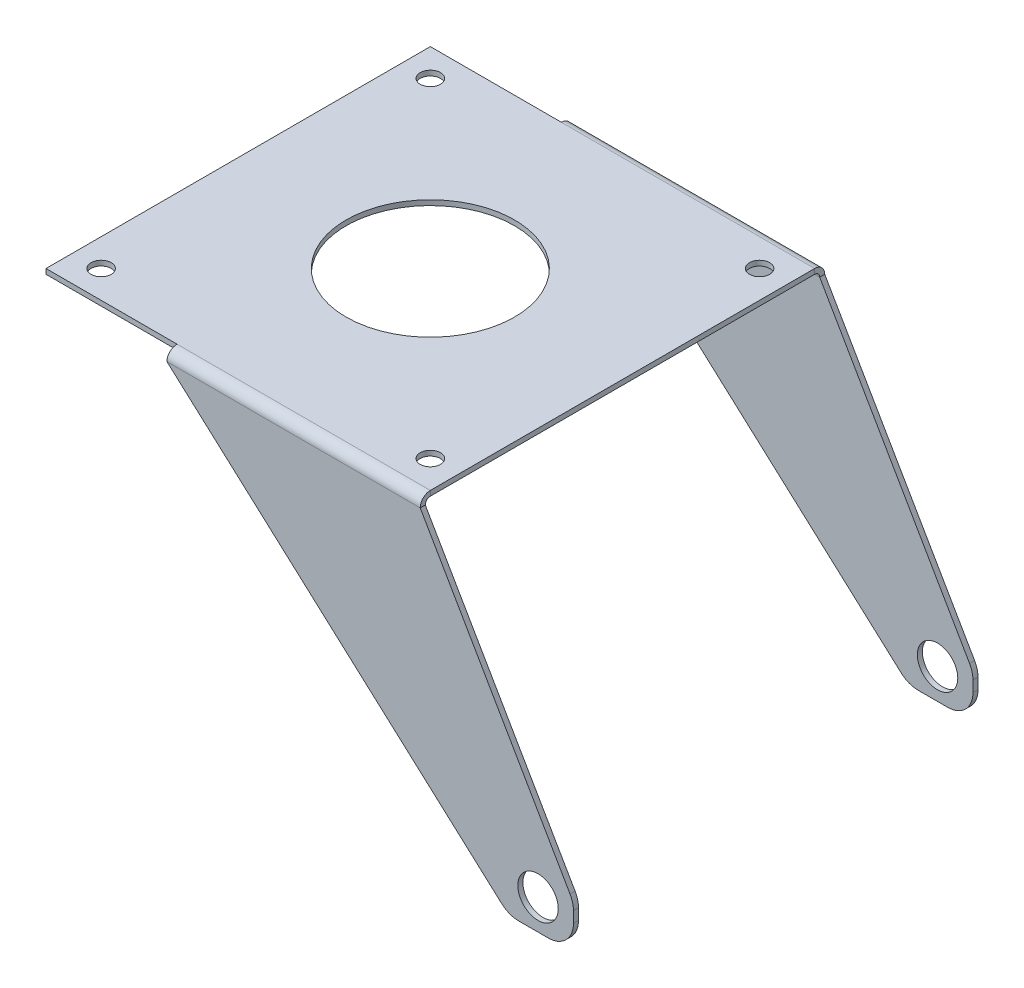
ISO-10303-21;
HEADER;
FILE_DESCRIPTION(('STEP AP214'),'2;1');
FILE_NAME('part.step','',(''),(''),'','','');
FILE_SCHEMA(('AUTOMOTIVE_DESIGN { 1 0 10303 214 1 1 1 1 }'));
ENDSEC;
DATA;
#1=APPLICATION_CONTEXT('core data for automotive mechanical design processes');
#2=APPLICATION_PROTOCOL_DEFINITION('international standard','automotive_design',2000,#1);
#3=PRODUCT_CONTEXT('',#1,'mechanical');
#4=PRODUCT('Part','Part','',(#3));
#5=PRODUCT_RELATED_PRODUCT_CATEGORY('part','',(#4));
#6=PRODUCT_DEFINITION_FORMATION('','',#4);
#7=PRODUCT_DEFINITION_CONTEXT('part definition',#1,'design');
#8=PRODUCT_DEFINITION('design','',#6,#7);
#9=PRODUCT_DEFINITION_SHAPE('','',#8);
#10=(LENGTH_UNIT() NAMED_UNIT(*) SI_UNIT(.MILLI.,.METRE.));
#11=(NAMED_UNIT(*) PLANE_ANGLE_UNIT() SI_UNIT($,.RADIAN.));
#12=(NAMED_UNIT(*) SI_UNIT($,.STERADIAN.) SOLID_ANGLE_UNIT());
#13=UNCERTAINTY_MEASURE_WITH_UNIT(LENGTH_MEASURE(1.E-05),#10,'distance_accuracy_value','');
#14=(GEOMETRIC_REPRESENTATION_CONTEXT(3) GLOBAL_UNCERTAINTY_ASSIGNED_CONTEXT((#13)) GLOBAL_UNIT_ASSIGNED_CONTEXT((#10,
#11,#12)) REPRESENTATION_CONTEXT('',''));
#15=CARTESIAN_POINT('',(0.,0.,0.));
#16=DIRECTION('',(0.,0.,1.));
#17=DIRECTION('',(1.,0.,0.));
#18=AXIS2_PLACEMENT_3D('',#15,#16,#17);
#19=CARTESIAN_POINT('',(0.,1.3533046551308E-13,40.));
#20=DIRECTION('',(0.,0.,-1.));
#21=DIRECTION('',(0.,-1.,0.));
#22=AXIS2_PLACEMENT_3D('',#19,#20,#21);
#23=PLANE('',#22);
#24=DIRECTION('',(-0.742561648426638,0.669777723043933,0.));
#25=VECTOR('',#24,1.);
#26=CARTESIAN_POINT('',(-6.41552604117496,-7.1126934037284,40.));
#27=LINE('',#26,#25);
#28=CARTESIAN_POINT('',(54.1179164484167,-61.7128082421332,40.0000000000002));
#29=VERTEX_POINT('',#28);
#30=CARTESIAN_POINT('',(-12.0838095793594,-1.99999999999999,40.));
#31=VERTEX_POINT('',#30);
#32=EDGE_CURVE('E229',#29,#31,#27,.T.);
#33=ORIENTED_EDGE('',*,*,#32,.F.);
#34=CARTESIAN_POINT('',(57.4668050636364,-58.,40.0000000000002));
#35=DIRECTION('',(0.,0.,-1.));
#36=DIRECTION('',(0.,1.,0.));
#37=AXIS2_PLACEMENT_3D('',#34,#35,#36);
#38=CIRCLE('',#37,5.);
#39=CARTESIAN_POINT('',(57.4668050636364,-63.,40.0000000000002));
#40=VERTEX_POINT('',#39);
#41=EDGE_CURVE('E313',#29,#40,#38,.F.);
#42=ORIENTED_EDGE('',*,*,#41,.T.);
#43=DIRECTION('',(1.,0.,0.));
#44=VECTOR('',#43,1.);
#45=CARTESIAN_POINT('',(-12.0838095793594,-63.,40.0000000000002));
#46=LINE('',#45,#44);
#47=CARTESIAN_POINT('',(63.3,-63.,40.0000000000002));
#48=VERTEX_POINT('',#47);
#49=EDGE_CURVE('E269',#48,#40,#46,.F.);
#50=ORIENTED_EDGE('',*,*,#49,.F.);
#51=CARTESIAN_POINT('',(63.3,-58.,40.0000000000002));
#52=DIRECTION('',(0.,0.,-1.));
#53=DIRECTION('',(0.,1.,0.));
#54=AXIS2_PLACEMENT_3D('',#51,#52,#53);
#55=CIRCLE('',#54,5.);
#56=CARTESIAN_POINT('',(68.3,-58.,40.0000000000002));
#57=VERTEX_POINT('',#56);
#58=EDGE_CURVE('E301',#48,#57,#55,.F.);
#59=ORIENTED_EDGE('',*,*,#58,.T.);
#60=DIRECTION('',(0.,-1.,0.));
#61=VECTOR('',#60,1.);
#62=CARTESIAN_POINT('',(68.3,-1.99999999999999,40.));
#63=LINE('',#62,#61);
#64=CARTESIAN_POINT('',(68.3,-55.8223144811084,40.0000000000002));
#65=VERTEX_POINT('',#64);
#66=EDGE_CURVE('E325',#65,#57,#63,.T.);
#67=ORIENTED_EDGE('',*,*,#66,.F.);
#68=CARTESIAN_POINT('',(63.3,-55.8223144811084,40.0000000000002));
#69=DIRECTION('',(0.,0.,-1.));
#70=DIRECTION('',(0.,1.,0.));
#71=AXIS2_PLACEMENT_3D('',#68,#69,#70);
#72=CIRCLE('',#71,5.);
#73=CARTESIAN_POINT('',(67.6301571614719,-53.3223666902629,40.0000000000002));
#74=VERTEX_POINT('',#73);
#75=EDGE_CURVE('E311',#65,#74,#72,.F.);
#76=ORIENTED_EDGE('',*,*,#75,.T.);
#77=DIRECTION('',(0.499989558169104,-0.866031432294386,0.));
#78=VECTOR('',#77,1.);
#79=CARTESIAN_POINT('',(27.634383439044,15.954274464794,39.9999999999999));
#80=LINE('',#79,#78);
#81=CARTESIAN_POINT('',(38.,-1.99999999999999,40.));
#82=VERTEX_POINT('',#81);
#83=EDGE_CURVE('E265',#82,#74,#80,.T.);
#84=ORIENTED_EDGE('',*,*,#83,.F.);
#85=DIRECTION('',(-1.,0.,0.));
#86=VECTOR('',#85,1.);
#87=CARTESIAN_POINT('',(38.,-1.99999999999999,40.));
#88=LINE('',#87,#86);
#89=EDGE_CURVE('E249',#31,#82,#88,.F.);
#90=ORIENTED_EDGE('',*,*,#89,.F.);
#91=EDGE_LOOP('',(#33,#42,#50,#59,#67,#76,#84,#90));
#92=FACE_BOUND('',#91,.T.);
#93=CARTESIAN_POINT('',(61.3,-57.,40.0000000000002));
#94=DIRECTION('',(0.,0.,-1.));
#95=DIRECTION('',(0.,1.,0.));
#96=AXIS2_PLACEMENT_3D('',#93,#94,#95);
#97=CIRCLE('',#96,4.);
#98=CARTESIAN_POINT('',(61.3,-53.,40.0000000000002));
#99=VERTEX_POINT('',#98);
#100=EDGE_CURVE('E347',#99,#99,#97,.T.);
#101=ORIENTED_EDGE('',*,*,#100,.T.);
#102=EDGE_LOOP('',(#101));
#103=FACE_BOUND('',#102,.T.);
#104=ADVANCED_FACE('F79',(#92,#103),#23,.F.);
#105=CARTESIAN_POINT('',(0.,1.31838984174237E-13,39.));
#106=DIRECTION('',(0.,0.,-1.));
#107=DIRECTION('',(0.,-1.,0.));
#108=AXIS2_PLACEMENT_3D('',#105,#106,#107);
#109=PLANE('',#108);
#110=DIRECTION('',(-1.,0.,0.));
#111=VECTOR('',#110,1.);
#112=CARTESIAN_POINT('',(0.,-63.,39.0000000000002));
#113=LINE('',#112,#111);
#114=CARTESIAN_POINT('',(63.3,-63.,39.0000000000002));
#115=VERTEX_POINT('',#114);
#116=CARTESIAN_POINT('',(57.4668050636364,-63.,39.0000000000002));
#117=VERTEX_POINT('',#116);
#118=EDGE_CURVE('E266',#115,#117,#113,.T.);
#119=ORIENTED_EDGE('',*,*,#118,.T.);
#120=CARTESIAN_POINT('',(57.4668050636364,-58.,39.0000000000002));
#121=DIRECTION('',(0.,0.,-1.));
#122=DIRECTION('',(0.,1.,0.));
#123=AXIS2_PLACEMENT_3D('',#120,#121,#122);
#124=CIRCLE('',#123,5.);
#125=CARTESIAN_POINT('',(54.1179164484167,-61.7128082421332,39.0000000000002));
#126=VERTEX_POINT('',#125);
#127=EDGE_CURVE('E318',#117,#126,#124,.T.);
#128=ORIENTED_EDGE('',*,*,#127,.T.);
#129=DIRECTION('',(-0.742561648426638,0.669777723043933,0.));
#130=VECTOR('',#129,1.);
#131=CARTESIAN_POINT('',(-6.41552604117496,-7.11269340372841,39.));
#132=LINE('',#131,#130);
#133=CARTESIAN_POINT('',(-12.0838095793594,-2.,39.));
#134=VERTEX_POINT('',#133);
#135=EDGE_CURVE('E241',#126,#134,#132,.T.);
#136=ORIENTED_EDGE('',*,*,#135,.T.);
#137=DIRECTION('',(-1.,0.,0.));
#138=VECTOR('',#137,1.);
#139=CARTESIAN_POINT('',(38.,-1.99999999999999,39.));
#140=LINE('',#139,#138);
#141=CARTESIAN_POINT('',(38.,-1.99999999999999,39.));
#142=VERTEX_POINT('',#141);
#143=EDGE_CURVE('E261',#142,#134,#140,.T.);
#144=ORIENTED_EDGE('',*,*,#143,.F.);
#145=DIRECTION('',(0.499989558169104,-0.866031432294386,0.));
#146=VECTOR('',#145,1.);
#147=CARTESIAN_POINT('',(27.634383439044,15.954274464794,38.9999999999999));
#148=LINE('',#147,#146);
#149=CARTESIAN_POINT('',(67.6301571614719,-53.3223666902629,39.0000000000002));
#150=VERTEX_POINT('',#149);
#151=EDGE_CURVE('E240',#142,#150,#148,.T.);
#152=ORIENTED_EDGE('',*,*,#151,.T.);
#153=CARTESIAN_POINT('',(63.3,-55.8223144811084,39.0000000000002));
#154=DIRECTION('',(0.,0.,-1.));
#155=DIRECTION('',(0.,1.,0.));
#156=AXIS2_PLACEMENT_3D('',#153,#154,#155);
#157=CIRCLE('',#156,5.);
#158=CARTESIAN_POINT('',(68.3,-55.8223144811084,39.0000000000002));
#159=VERTEX_POINT('',#158);
#160=EDGE_CURVE('E95',#150,#159,#157,.T.);
#161=ORIENTED_EDGE('',*,*,#160,.T.);
#162=DIRECTION('',(0.,-1.,0.));
#163=VECTOR('',#162,1.);
#164=CARTESIAN_POINT('',(68.3,-2.,39.));
#165=LINE('',#164,#163);
#166=CARTESIAN_POINT('',(68.3,-58.,39.0000000000002));
#167=VERTEX_POINT('',#166);
#168=EDGE_CURVE('E276',#159,#167,#165,.T.);
#169=ORIENTED_EDGE('',*,*,#168,.T.);
#170=CARTESIAN_POINT('',(63.3,-58.,39.0000000000002));
#171=DIRECTION('',(0.,0.,-1.));
#172=DIRECTION('',(0.,1.,0.));
#173=AXIS2_PLACEMENT_3D('',#170,#171,#172);
#174=CIRCLE('',#173,5.);
#175=EDGE_CURVE('E308',#167,#115,#174,.T.);
#176=ORIENTED_EDGE('',*,*,#175,.T.);
#177=EDGE_LOOP('',(#119,#128,#136,#144,#152,#161,#169,#176));
#178=FACE_BOUND('',#177,.T.);
#179=CARTESIAN_POINT('',(61.3,-57.,39.0000000000002));
#180=DIRECTION('',(0.,0.,-1.));
#181=DIRECTION('',(0.,1.,0.));
#182=AXIS2_PLACEMENT_3D('',#179,#180,#181);
#183=CIRCLE('',#182,4.);
#184=CARTESIAN_POINT('',(61.3,-53.,39.0000000000002));
#185=VERTEX_POINT('',#184);
#186=EDGE_CURVE('E83',#185,#185,#183,.F.);
#187=ORIENTED_EDGE('',*,*,#186,.T.);
#188=EDGE_LOOP('',(#187));
#189=FACE_BOUND('',#188,.T.);
#190=ADVANCED_FACE('F342',(#178,#189),#109,.T.);
#191=CARTESIAN_POINT('',(-12.0838095793594,-63.,40.0000000000002));
#192=DIRECTION('',(0.,-1.,0.));
#193=DIRECTION('',(0.,0.,-1.));
#194=AXIS2_PLACEMENT_3D('',#191,#192,#193);
#195=PLANE('',#194);
#196=ORIENTED_EDGE('',*,*,#49,.T.);
#197=DIRECTION('',(0.,0.,1.));
#198=VECTOR('',#197,1.);
#199=CARTESIAN_POINT('',(57.4668050636364,-63.,40.0000000000002));
#200=LINE('',#199,#198);
#201=EDGE_CURVE('E315',#40,#117,#200,.F.);
#202=ORIENTED_EDGE('',*,*,#201,.T.);
#203=ORIENTED_EDGE('',*,*,#118,.F.);
#204=DIRECTION('',(0.,0.,1.));
#205=VECTOR('',#204,1.);
#206=CARTESIAN_POINT('',(63.3,-63.,40.0000000000002));
#207=LINE('',#206,#205);
#208=EDGE_CURVE('E298',#115,#48,#207,.T.);
#209=ORIENTED_EDGE('',*,*,#208,.T.);
#210=EDGE_LOOP('',(#196,#202,#203,#209));
#211=FACE_BOUND('',#210,.T.);
#212=ADVANCED_FACE('F336',(#211),#195,.T.);
#213=CARTESIAN_POINT('',(68.3,-2.,39.));
#214=DIRECTION('',(-1.,0.,0.));
#215=DIRECTION('',(0.,-1.,0.));
#216=AXIS2_PLACEMENT_3D('',#213,#214,#215);
#217=PLANE('',#216);
#218=ORIENTED_EDGE('',*,*,#168,.F.);
#219=DIRECTION('',(0.,0.,1.));
#220=VECTOR('',#219,1.);
#221=CARTESIAN_POINT('',(68.3,-55.8223144811084,40.0000000000002));
#222=LINE('',#221,#220);
#223=EDGE_CURVE('E88',#159,#65,#222,.T.);
#224=ORIENTED_EDGE('',*,*,#223,.T.);
#225=ORIENTED_EDGE('',*,*,#66,.T.);
#226=DIRECTION('',(0.,0.,1.));
#227=VECTOR('',#226,1.);
#228=CARTESIAN_POINT('',(68.3,-58.,39.0000000000002));
#229=LINE('',#228,#227);
#230=EDGE_CURVE('E305',#57,#167,#229,.F.);
#231=ORIENTED_EDGE('',*,*,#230,.T.);
#232=EDGE_LOOP('',(#218,#224,#225,#231));
#233=FACE_BOUND('',#232,.T.);
#234=ADVANCED_FACE('F324',(#233),#217,.F.);
#235=CARTESIAN_POINT('',(-38.,-1.,38.));
#236=DIRECTION('',(0.,0.,1.));
#237=DIRECTION('',(1.,0.,0.));
#238=AXIS2_PLACEMENT_3D('',#235,#236,#237);
#239=PLANE('',#238);
#240=DIRECTION('',(1.,0.,0.));
#241=VECTOR('',#240,1.);
#242=CARTESIAN_POINT('',(-38.,-1.,38.));
#243=LINE('',#242,#241);
#244=CARTESIAN_POINT('',(-38.,-1.,38.));
#245=VERTEX_POINT('',#244);
#246=CARTESIAN_POINT('',(-12.0838095793594,-1.,38.));
#247=VERTEX_POINT('',#246);
#248=EDGE_CURVE('E501',#245,#247,#243,.T.);
#249=ORIENTED_EDGE('',*,*,#248,.T.);
#250=DIRECTION('',(0.,1.,0.));
#251=VECTOR('',#250,1.);
#252=CARTESIAN_POINT('',(-12.0838095793594,-1.,38.));
#253=LINE('',#252,#251);
#254=CARTESIAN_POINT('',(-12.0838095793594,0.,38.));
#255=VERTEX_POINT('',#254);
#256=EDGE_CURVE('E279',#247,#255,#253,.T.);
#257=ORIENTED_EDGE('',*,*,#256,.T.);
#258=DIRECTION('',(1.,0.,0.));
#259=VECTOR('',#258,1.);
#260=CARTESIAN_POINT('',(-38.,0.,38.));
#261=LINE('',#260,#259);
#262=CARTESIAN_POINT('',(-38.,0.,38.));
#263=VERTEX_POINT('',#262);
#264=EDGE_CURVE('E517',#263,#255,#261,.T.);
#265=ORIENTED_EDGE('',*,*,#264,.F.);
#266=DIRECTION('',(0.,1.,0.));
#267=VECTOR('',#266,1.);
#268=CARTESIAN_POINT('',(-38.,-1.,38.));
#269=LINE('',#268,#267);
#270=EDGE_CURVE('E506',#245,#263,#269,.T.);
#271=ORIENTED_EDGE('',*,*,#270,.F.);
#272=EDGE_LOOP('',(#249,#257,#265,#271));
#273=FACE_BOUND('',#272,.T.);
#274=ADVANCED_FACE('F407',(#273),#239,.T.);
#275=CARTESIAN_POINT('',(0.,1.3533046551308E-13,-40.));
#276=DIRECTION('',(0.,0.,1.));
#277=DIRECTION('',(0.,-1.,0.));
#278=AXIS2_PLACEMENT_3D('',#275,#276,#277);
#279=PLANE('',#278);
#280=CARTESIAN_POINT('',(61.3,-57.,-40.0000000000002));
#281=DIRECTION('',(0.,0.,-1.));
#282=DIRECTION('',(0.,1.,0.));
#283=AXIS2_PLACEMENT_3D('',#280,#281,#282);
#284=CIRCLE('',#283,4.);
#285=CARTESIAN_POINT('',(61.3,-53.,-40.0000000000002));
#286=VERTEX_POINT('',#285);
#287=EDGE_CURVE('E285',#286,#286,#284,.T.);
#288=ORIENTED_EDGE('',*,*,#287,.F.);
#289=EDGE_LOOP('',(#288));
#290=FACE_BOUND('',#289,.T.);
#291=DIRECTION('',(-1.,0.,0.));
#292=VECTOR('',#291,1.);
#293=CARTESIAN_POINT('',(0.,-63.,-40.0000000000002));
#294=LINE('',#293,#292);
#295=CARTESIAN_POINT('',(63.3,-63.,-40.0000000000002));
#296=VERTEX_POINT('',#295);
#297=CARTESIAN_POINT('',(57.4668050636364,-63.,-40.0000000000002));
#298=VERTEX_POINT('',#297);
#299=EDGE_CURVE('E630',#296,#298,#294,.T.);
#300=ORIENTED_EDGE('',*,*,#299,.T.);
#301=CARTESIAN_POINT('',(57.4668050636364,-58.,-40.0000000000002));
#302=DIRECTION('',(0.,0.,1.));
#303=DIRECTION('',(0.,-1.,0.));
#304=AXIS2_PLACEMENT_3D('',#301,#302,#303);
#305=CIRCLE('',#304,5.);
#306=CARTESIAN_POINT('',(54.1179164484167,-61.7128082421332,-40.0000000000002));
#307=VERTEX_POINT('',#306);
#308=EDGE_CURVE('E607',#298,#307,#305,.F.);
#309=ORIENTED_EDGE('',*,*,#308,.T.);
#310=DIRECTION('',(-0.742561648426638,0.669777723043933,0.));
#311=VECTOR('',#310,1.);
#312=CARTESIAN_POINT('',(-6.41552604117496,-7.1126934037284,-40.));
#313=LINE('',#312,#311);
#314=CARTESIAN_POINT('',(-12.0838095793594,-1.99999999999999,-40.));
#315=VERTEX_POINT('',#314);
#316=EDGE_CURVE('E622',#307,#315,#313,.T.);
#317=ORIENTED_EDGE('',*,*,#316,.T.);
#318=DIRECTION('',(1.,0.,0.));
#319=VECTOR('',#318,1.);
#320=CARTESIAN_POINT('',(-12.0838095793594,-1.99999999999999,-40.));
#321=LINE('',#320,#319);
#322=CARTESIAN_POINT('',(38.,-1.99999999999999,-40.));
#323=VERTEX_POINT('',#322);
#324=EDGE_CURVE('E638',#323,#315,#321,.F.);
#325=ORIENTED_EDGE('',*,*,#324,.F.);
#326=DIRECTION('',(0.499989558169104,-0.866031432294386,0.));
#327=VECTOR('',#326,1.);
#328=CARTESIAN_POINT('',(27.634383439044,15.954274464794,-39.9999999999999));
#329=LINE('',#328,#327);
#330=CARTESIAN_POINT('',(67.6301571614719,-53.3223666902629,-40.0000000000002));
#331=VERTEX_POINT('',#330);
#332=EDGE_CURVE('E683',#323,#331,#329,.T.);
#333=ORIENTED_EDGE('',*,*,#332,.T.);
#334=CARTESIAN_POINT('',(63.3,-55.8223144811084,-40.0000000000002));
#335=DIRECTION('',(0.,0.,1.));
#336=DIRECTION('',(0.,-1.,0.));
#337=AXIS2_PLACEMENT_3D('',#334,#335,#336);
#338=CIRCLE('',#337,5.);
#339=CARTESIAN_POINT('',(68.3,-55.8223144811084,-40.0000000000002));
#340=VERTEX_POINT('',#339);
#341=EDGE_CURVE('E605',#331,#340,#338,.F.);
#342=ORIENTED_EDGE('',*,*,#341,.T.);
#343=DIRECTION('',(0.,-1.,0.));
#344=VECTOR('',#343,1.);
#345=CARTESIAN_POINT('',(68.3,-1.99999999999999,-40.));
#346=LINE('',#345,#344);
#347=CARTESIAN_POINT('',(68.3,-58.,-40.0000000000002));
#348=VERTEX_POINT('',#347);
#349=EDGE_CURVE('E641',#340,#348,#346,.T.);
#350=ORIENTED_EDGE('',*,*,#349,.T.);
#351=CARTESIAN_POINT('',(63.3,-58.,-40.0000000000002));
#352=DIRECTION('',(0.,0.,1.));
#353=DIRECTION('',(0.,-1.,0.));
#354=AXIS2_PLACEMENT_3D('',#351,#352,#353);
#355=CIRCLE('',#354,5.);
#356=EDGE_CURVE('E594',#348,#296,#355,.F.);
#357=ORIENTED_EDGE('',*,*,#356,.T.);
#358=EDGE_LOOP('',(#300,#309,#317,#325,#333,#342,#350,#357));
#359=FACE_BOUND('',#358,.T.);
#360=ADVANCED_FACE('F403',(#290,#359),#279,.F.);
#361=CARTESIAN_POINT('',(0.,1.31838984174237E-13,-39.));
#362=DIRECTION('',(0.,0.,1.));
#363=DIRECTION('',(0.,-1.,0.));
#364=AXIS2_PLACEMENT_3D('',#361,#362,#363);
#365=PLANE('',#364);
#366=CARTESIAN_POINT('',(61.3,-57.,-39.0000000000002));
#367=DIRECTION('',(0.,0.,1.));
#368=DIRECTION('',(0.,-1.,0.));
#369=AXIS2_PLACEMENT_3D('',#366,#367,#368);
#370=CIRCLE('',#369,4.);
#371=CARTESIAN_POINT('',(61.3,-61.,-39.0000000000002));
#372=VERTEX_POINT('',#371);
#373=EDGE_CURVE('E618',#372,#372,#370,.T.);
#374=ORIENTED_EDGE('',*,*,#373,.F.);
#375=EDGE_LOOP('',(#374));
#376=FACE_BOUND('',#375,.T.);
#377=DIRECTION('',(-0.742561648426638,0.669777723043933,0.));
#378=VECTOR('',#377,1.);
#379=CARTESIAN_POINT('',(-6.41552604117496,-7.11269340372841,-39.));
#380=LINE('',#379,#378);
#381=CARTESIAN_POINT('',(54.1179164484167,-61.7128082421332,-39.0000000000002));
#382=VERTEX_POINT('',#381);
#383=CARTESIAN_POINT('',(-12.0838095793594,-2.,-39.));
#384=VERTEX_POINT('',#383);
#385=EDGE_CURVE('E620',#382,#384,#380,.T.);
#386=ORIENTED_EDGE('',*,*,#385,.F.);
#387=CARTESIAN_POINT('',(57.4668050636364,-58.,-39.0000000000002));
#388=DIRECTION('',(0.,0.,1.));
#389=DIRECTION('',(0.,-1.,0.));
#390=AXIS2_PLACEMENT_3D('',#387,#388,#389);
#391=CIRCLE('',#390,5.);
#392=CARTESIAN_POINT('',(57.4668050636364,-63.,-39.0000000000002));
#393=VERTEX_POINT('',#392);
#394=EDGE_CURVE('E613',#382,#393,#391,.T.);
#395=ORIENTED_EDGE('',*,*,#394,.T.);
#396=DIRECTION('',(1.,0.,0.));
#397=VECTOR('',#396,1.);
#398=CARTESIAN_POINT('',(-12.0838095793594,-63.,-39.0000000000002));
#399=LINE('',#398,#397);
#400=CARTESIAN_POINT('',(63.3,-63.,-39.0000000000002));
#401=VERTEX_POINT('',#400);
#402=EDGE_CURVE('E634',#401,#393,#399,.F.);
#403=ORIENTED_EDGE('',*,*,#402,.F.);
#404=CARTESIAN_POINT('',(63.3,-58.,-39.0000000000002));
#405=DIRECTION('',(0.,0.,1.));
#406=DIRECTION('',(0.,-1.,0.));
#407=AXIS2_PLACEMENT_3D('',#404,#405,#406);
#408=CIRCLE('',#407,5.);
#409=CARTESIAN_POINT('',(68.3,-58.,-39.0000000000002));
#410=VERTEX_POINT('',#409);
#411=EDGE_CURVE('E599',#401,#410,#408,.T.);
#412=ORIENTED_EDGE('',*,*,#411,.T.);
#413=DIRECTION('',(0.,-1.,0.));
#414=VECTOR('',#413,1.);
#415=CARTESIAN_POINT('',(68.3,-2.,-39.));
#416=LINE('',#415,#414);
#417=CARTESIAN_POINT('',(68.3,-55.8223144811084,-39.0000000000002));
#418=VERTEX_POINT('',#417);
#419=EDGE_CURVE('E654',#418,#410,#416,.T.);
#420=ORIENTED_EDGE('',*,*,#419,.F.);
#421=CARTESIAN_POINT('',(63.3,-55.8223144811084,-39.0000000000002));
#422=DIRECTION('',(0.,0.,1.));
#423=DIRECTION('',(0.,-1.,0.));
#424=AXIS2_PLACEMENT_3D('',#421,#422,#423);
#425=CIRCLE('',#424,5.);
#426=CARTESIAN_POINT('',(67.6301571614719,-53.3223666902629,-39.0000000000002));
#427=VERTEX_POINT('',#426);
#428=EDGE_CURVE('E611',#418,#427,#425,.T.);
#429=ORIENTED_EDGE('',*,*,#428,.T.);
#430=DIRECTION('',(0.499989558169104,-0.866031432294386,0.));
#431=VECTOR('',#430,1.);
#432=CARTESIAN_POINT('',(27.634383439044,15.954274464794,-38.9999999999999));
#433=LINE('',#432,#431);
#434=CARTESIAN_POINT('',(38.,-1.99999999999999,-39.));
#435=VERTEX_POINT('',#434);
#436=EDGE_CURVE('E679',#435,#427,#433,.T.);
#437=ORIENTED_EDGE('',*,*,#436,.F.);
#438=DIRECTION('',(1.,0.,0.));
#439=VECTOR('',#438,1.);
#440=CARTESIAN_POINT('',(-12.0838095793594,-1.99999999999999,-39.));
#441=LINE('',#440,#439);
#442=EDGE_CURVE('E649',#384,#435,#441,.T.);
#443=ORIENTED_EDGE('',*,*,#442,.F.);
#444=EDGE_LOOP('',(#386,#395,#403,#412,#420,#429,#437,#443));
#445=FACE_BOUND('',#444,.T.);
#446=ADVANCED_FACE('F406',(#376,#445),#365,.T.);
#447=CARTESIAN_POINT('',(-12.0838095793594,-63.,-40.0000000000002));
#448=DIRECTION('',(0.,1.,0.));
#449=DIRECTION('',(0.,0.,1.));
#450=AXIS2_PLACEMENT_3D('',#447,#448,#449);
#451=PLANE('',#450);
#452=ORIENTED_EDGE('',*,*,#402,.T.);
#453=DIRECTION('',(0.,0.,1.));
#454=VECTOR('',#453,1.);
#455=CARTESIAN_POINT('',(57.4668050636364,-63.,-40.0000000000002));
#456=LINE('',#455,#454);
#457=EDGE_CURVE('E602',#393,#298,#456,.F.);
#458=ORIENTED_EDGE('',*,*,#457,.T.);
#459=ORIENTED_EDGE('',*,*,#299,.F.);
#460=DIRECTION('',(0.,0.,-1.));
#461=VECTOR('',#460,1.);
#462=CARTESIAN_POINT('',(63.3,-63.,-39.0000000000002));
#463=LINE('',#462,#461);
#464=EDGE_CURVE('E597',#296,#401,#463,.F.);
#465=ORIENTED_EDGE('',*,*,#464,.T.);
#466=EDGE_LOOP('',(#452,#458,#459,#465));
#467=FACE_BOUND('',#466,.T.);
#468=ADVANCED_FACE('F401',(#467),#451,.F.);
#469=CARTESIAN_POINT('',(68.3,-2.,-39.));
#470=DIRECTION('',(1.,0.,0.));
#471=DIRECTION('',(0.,1.,0.));
#472=AXIS2_PLACEMENT_3D('',#469,#470,#471);
#473=PLANE('',#472);
#474=ORIENTED_EDGE('',*,*,#349,.F.);
#475=DIRECTION('',(0.,0.,1.));
#476=VECTOR('',#475,1.);
#477=CARTESIAN_POINT('',(68.3,-55.8223144811084,-39.0000000000002));
#478=LINE('',#477,#476);
#479=EDGE_CURVE('E302',#340,#418,#478,.T.);
#480=ORIENTED_EDGE('',*,*,#479,.T.);
#481=ORIENTED_EDGE('',*,*,#419,.T.);
#482=DIRECTION('',(0.,0.,-1.));
#483=VECTOR('',#482,1.);
#484=CARTESIAN_POINT('',(68.3,-58.,-40.0000000000002));
#485=LINE('',#484,#483);
#486=EDGE_CURVE('E591',#410,#348,#485,.T.);
#487=ORIENTED_EDGE('',*,*,#486,.T.);
#488=EDGE_LOOP('',(#474,#480,#481,#487));
#489=FACE_BOUND('',#488,.T.);
#490=ADVANCED_FACE('F397',(#489),#473,.T.);
#491=CARTESIAN_POINT('',(38.,-1.,38.));
#492=DIRECTION('',(1.,0.,0.));
#493=DIRECTION('',(0.,0.,-1.));
#494=AXIS2_PLACEMENT_3D('',#491,#492,#493);
#495=PLANE('',#494);
#496=DIRECTION('',(0.,0.,-1.));
#497=VECTOR('',#496,1.);
#498=CARTESIAN_POINT('',(38.,0.,38.));
#499=LINE('',#498,#497);
#500=CARTESIAN_POINT('',(38.,0.,38.));
#501=VERTEX_POINT('',#500);
#502=CARTESIAN_POINT('',(38.,0.,-38.));
#503=VERTEX_POINT('',#502);
#504=EDGE_CURVE('E524',#501,#503,#499,.T.);
#505=ORIENTED_EDGE('',*,*,#504,.F.);
#506=DIRECTION('',(0.,1.,0.));
#507=VECTOR('',#506,1.);
#508=CARTESIAN_POINT('',(38.,-1.,38.));
#509=LINE('',#508,#507);
#510=CARTESIAN_POINT('',(38.,-1.,38.));
#511=VERTEX_POINT('',#510);
#512=EDGE_CURVE('E595',#511,#501,#509,.T.);
#513=ORIENTED_EDGE('',*,*,#512,.F.);
#514=DIRECTION('',(0.,0.,-1.));
#515=VECTOR('',#514,1.);
#516=CARTESIAN_POINT('',(38.,-1.,38.));
#517=LINE('',#516,#515);
#518=CARTESIAN_POINT('',(38.,-1.,-38.));
#519=VERTEX_POINT('',#518);
#520=EDGE_CURVE('E503',#511,#519,#517,.T.);
#521=ORIENTED_EDGE('',*,*,#520,.T.);
#522=DIRECTION('',(0.,1.,0.));
#523=VECTOR('',#522,1.);
#524=CARTESIAN_POINT('',(38.,-1.,-38.));
#525=LINE('',#524,#523);
#526=EDGE_CURVE('E508',#519,#503,#525,.T.);
#527=ORIENTED_EDGE('',*,*,#526,.T.);
#528=EDGE_LOOP('',(#505,#513,#521,#527));
#529=FACE_BOUND('',#528,.T.);
#530=ADVANCED_FACE('F400',(#529),#495,.T.);
#531=CARTESIAN_POINT('',(-38.,-1.,38.));
#532=DIRECTION('',(-1.,0.,0.));
#533=DIRECTION('',(0.,0.,1.));
#534=AXIS2_PLACEMENT_3D('',#531,#532,#533);
#535=PLANE('',#534);
#536=DIRECTION('',(0.,0.,1.));
#537=VECTOR('',#536,1.);
#538=CARTESIAN_POINT('',(-38.,0.,38.));
#539=LINE('',#538,#537);
#540=CARTESIAN_POINT('',(-38.,0.,-38.));
#541=VERTEX_POINT('',#540);
#542=EDGE_CURVE('E531',#541,#263,#539,.T.);
#543=ORIENTED_EDGE('',*,*,#542,.F.);
#544=DIRECTION('',(0.,1.,0.));
#545=VECTOR('',#544,1.);
#546=CARTESIAN_POINT('',(-38.,-1.,-38.));
#547=LINE('',#546,#545);
#548=CARTESIAN_POINT('',(-38.,-1.,-38.));
#549=VERTEX_POINT('',#548);
#550=EDGE_CURVE('E511',#549,#541,#547,.T.);
#551=ORIENTED_EDGE('',*,*,#550,.F.);
#552=DIRECTION('',(0.,0.,1.));
#553=VECTOR('',#552,1.);
#554=CARTESIAN_POINT('',(-38.,-1.,38.));
#555=LINE('',#554,#553);
#556=EDGE_CURVE('E509',#549,#245,#555,.T.);
#557=ORIENTED_EDGE('',*,*,#556,.T.);
#558=ORIENTED_EDGE('',*,*,#270,.T.);
#559=EDGE_LOOP('',(#543,#551,#557,#558));
#560=FACE_BOUND('',#559,.T.);
#561=ADVANCED_FACE('F463',(#560),#535,.T.);
#562=CARTESIAN_POINT('',(-38.,-1.,-38.));
#563=DIRECTION('',(0.,0.,-1.));
#564=DIRECTION('',(-1.,0.,0.));
#565=AXIS2_PLACEMENT_3D('',#562,#563,#564);
#566=PLANE('',#565);
#567=DIRECTION('',(0.,1.,0.));
#568=VECTOR('',#567,1.);
#569=CARTESIAN_POINT('',(-12.0838095793594,-1.00000000000001,-38.));
#570=LINE('',#569,#568);
#571=CARTESIAN_POINT('',(-12.0838095793594,-1.,-38.));
#572=VERTEX_POINT('',#571);
#573=CARTESIAN_POINT('',(-12.0838095793594,0.,-38.));
#574=VERTEX_POINT('',#573);
#575=EDGE_CURVE('E573',#572,#574,#570,.T.);
#576=ORIENTED_EDGE('',*,*,#575,.F.);
#577=DIRECTION('',(-1.,0.,0.));
#578=VECTOR('',#577,1.);
#579=CARTESIAN_POINT('',(-38.,-1.,-38.));
#580=LINE('',#579,#578);
#581=EDGE_CURVE('E537',#572,#549,#580,.T.);
#582=ORIENTED_EDGE('',*,*,#581,.T.);
#583=ORIENTED_EDGE('',*,*,#550,.T.);
#584=DIRECTION('',(-1.,0.,0.));
#585=VECTOR('',#584,1.);
#586=CARTESIAN_POINT('',(-38.,0.,-38.));
#587=LINE('',#586,#585);
#588=EDGE_CURVE('E527',#574,#541,#587,.T.);
#589=ORIENTED_EDGE('',*,*,#588,.F.);
#590=EDGE_LOOP('',(#576,#582,#583,#589));
#591=FACE_BOUND('',#590,.T.);
#592=ADVANCED_FACE('F455',(#591),#566,.T.);
#593=CARTESIAN_POINT('',(0.,-1.,0.));
#594=DIRECTION('',(0.,-1.,0.));
#595=DIRECTION('',(0.,0.,-1.));
#596=AXIS2_PLACEMENT_3D('',#593,#594,#595);
#597=PLANE('',#596);
#598=CARTESIAN_POINT('',(32.5500000000003,-0.999999999999999,32.5499999999996));
#599=DIRECTION('',(0.,-1.,0.));
#600=DIRECTION('',(0.,0.,-1.));
#601=AXIS2_PLACEMENT_3D('',#598,#599,#600);
#602=CIRCLE('',#601,2.);
#603=CARTESIAN_POINT('',(32.5500000000003,-0.999999999999999,30.5499999999996));
#604=VERTEX_POINT('',#603);
#605=EDGE_CURVE('E567',#604,#604,#602,.T.);
#606=ORIENTED_EDGE('',*,*,#605,.F.);
#607=EDGE_LOOP('',(#606));
#608=FACE_BOUND('',#607,.T.);
#609=CARTESIAN_POINT('',(-32.55,-0.999999999999999,32.55));
#610=DIRECTION('',(0.,-1.,0.));
#611=DIRECTION('',(0.,0.,-1.));
#612=AXIS2_PLACEMENT_3D('',#609,#610,#611);
#613=CIRCLE('',#612,2.);
#614=CARTESIAN_POINT('',(-32.55,-0.999999999999999,30.55));
#615=VERTEX_POINT('',#614);
#616=EDGE_CURVE('E561',#615,#615,#613,.T.);
#617=ORIENTED_EDGE('',*,*,#616,.F.);
#618=EDGE_LOOP('',(#617));
#619=FACE_BOUND('',#618,.T.);
#620=CARTESIAN_POINT('',(-32.5500000000001,-0.999999999999999,-32.5499999999999));
#621=DIRECTION('',(0.,-1.,0.));
#622=DIRECTION('',(0.,0.,-1.));
#623=AXIS2_PLACEMENT_3D('',#620,#621,#622);
#624=CIRCLE('',#623,2.);
#625=CARTESIAN_POINT('',(-32.5500000000001,-0.999999999999999,-34.5499999999999));
#626=VERTEX_POINT('',#625);
#627=EDGE_CURVE('E555',#626,#626,#624,.T.);
#628=ORIENTED_EDGE('',*,*,#627,.F.);
#629=EDGE_LOOP('',(#628));
#630=FACE_BOUND('',#629,.T.);
#631=CARTESIAN_POINT('',(0.,-0.999999999999999,0.));
#632=DIRECTION('',(0.,-1.,0.));
#633=DIRECTION('',(0.,0.,-1.));
#634=AXIS2_PLACEMENT_3D('',#631,#632,#633);
#635=CIRCLE('',#634,16.65);
#636=CARTESIAN_POINT('',(0.,-0.999999999999999,-16.65));
#637=VERTEX_POINT('',#636);
#638=EDGE_CURVE('E549',#637,#637,#635,.T.);
#639=ORIENTED_EDGE('',*,*,#638,.F.);
#640=EDGE_LOOP('',(#639));
#641=FACE_BOUND('',#640,.T.);
#642=CARTESIAN_POINT('',(32.55,-0.999999999999999,-32.55));
#643=DIRECTION('',(0.,-1.,0.));
#644=DIRECTION('',(0.,0.,-1.));
#645=AXIS2_PLACEMENT_3D('',#642,#643,#644);
#646=CIRCLE('',#645,2.);
#647=CARTESIAN_POINT('',(32.55,-0.999999999999999,-34.55));
#648=VERTEX_POINT('',#647);
#649=EDGE_CURVE('E528',#648,#648,#646,.T.);
#650=ORIENTED_EDGE('',*,*,#649,.F.);
#651=EDGE_LOOP('',(#650));
#652=FACE_BOUND('',#651,.T.);
#653=ORIENTED_EDGE('',*,*,#520,.F.);
#654=DIRECTION('',(-1.,0.,0.));
#655=VECTOR('',#654,1.);
#656=CARTESIAN_POINT('',(-12.0838095793594,-1.,38.));
#657=LINE('',#656,#655);
#658=EDGE_CURVE('E282',#247,#511,#657,.F.);
#659=ORIENTED_EDGE('',*,*,#658,.F.);
#660=ORIENTED_EDGE('',*,*,#248,.F.);
#661=ORIENTED_EDGE('',*,*,#556,.F.);
#662=ORIENTED_EDGE('',*,*,#581,.F.);
#663=EDGE_CURVE('E513',#519,#572,#580,.T.);
#664=ORIENTED_EDGE('',*,*,#663,.F.);
#665=EDGE_LOOP('',(#653,#659,#660,#661,#662,#664));
#666=FACE_BOUND('',#665,.T.);
#667=ADVANCED_FACE('F452',(#608,#619,#630,#641,#652,#666),#597,.T.);
#668=CARTESIAN_POINT('',(0.,0.,0.));
#669=DIRECTION('',(0.,-1.,0.));
#670=DIRECTION('',(0.,0.,-1.));
#671=AXIS2_PLACEMENT_3D('',#668,#669,#670);
#672=PLANE('',#671);
#673=CARTESIAN_POINT('',(32.5500000000003,0.,32.5499999999996));
#674=DIRECTION('',(0.,1.,0.));
#675=DIRECTION('',(-1.,0.,0.));
#676=AXIS2_PLACEMENT_3D('',#673,#674,#675);
#677=CIRCLE('',#676,2.);
#678=CARTESIAN_POINT('',(30.5500000000003,0.,32.5499999999997));
#679=VERTEX_POINT('',#678);
#680=EDGE_CURVE('E570',#679,#679,#677,.T.);
#681=ORIENTED_EDGE('',*,*,#680,.F.);
#682=EDGE_LOOP('',(#681));
#683=FACE_BOUND('',#682,.T.);
#684=CARTESIAN_POINT('',(-32.55,0.,32.55));
#685=DIRECTION('',(0.,1.,0.));
#686=DIRECTION('',(0.,0.,-1.));
#687=AXIS2_PLACEMENT_3D('',#684,#685,#686);
#688=CIRCLE('',#687,2.);
#689=CARTESIAN_POINT('',(-32.55,0.,30.55));
#690=VERTEX_POINT('',#689);
#691=EDGE_CURVE('E564',#690,#690,#688,.T.);
#692=ORIENTED_EDGE('',*,*,#691,.F.);
#693=EDGE_LOOP('',(#692));
#694=FACE_BOUND('',#693,.T.);
#695=CARTESIAN_POINT('',(-32.5500000000001,0.,-32.5499999999999));
#696=DIRECTION('',(0.,1.,0.));
#697=DIRECTION('',(1.,0.,0.));
#698=AXIS2_PLACEMENT_3D('',#695,#696,#697);
#699=CIRCLE('',#698,2.);
#700=CARTESIAN_POINT('',(-30.5500000000001,0.,-32.5499999999999));
#701=VERTEX_POINT('',#700);
#702=EDGE_CURVE('E558',#701,#701,#699,.T.);
#703=ORIENTED_EDGE('',*,*,#702,.F.);
#704=EDGE_LOOP('',(#703));
#705=FACE_BOUND('',#704,.T.);
#706=CARTESIAN_POINT('',(0.,0.,0.));
#707=DIRECTION('',(0.,1.,0.));
#708=DIRECTION('',(0.,0.,1.));
#709=AXIS2_PLACEMENT_3D('',#706,#707,#708);
#710=CIRCLE('',#709,16.65);
#711=CARTESIAN_POINT('',(0.,0.,16.65));
#712=VERTEX_POINT('',#711);
#713=EDGE_CURVE('E552',#712,#712,#710,.T.);
#714=ORIENTED_EDGE('',*,*,#713,.F.);
#715=EDGE_LOOP('',(#714));
#716=FACE_BOUND('',#715,.T.);
#717=CARTESIAN_POINT('',(32.55,0.,-32.55));
#718=DIRECTION('',(0.,1.,0.));
#719=DIRECTION('',(0.,0.,1.));
#720=AXIS2_PLACEMENT_3D('',#717,#718,#719);
#721=CIRCLE('',#720,2.);
#722=CARTESIAN_POINT('',(32.55,0.,-30.55));
#723=VERTEX_POINT('',#722);
#724=EDGE_CURVE('E546',#723,#723,#721,.T.);
#725=ORIENTED_EDGE('',*,*,#724,.F.);
#726=EDGE_LOOP('',(#725));
#727=FACE_BOUND('',#726,.T.);
#728=ORIENTED_EDGE('',*,*,#504,.T.);
#729=EDGE_CURVE('E535',#503,#574,#587,.T.);
#730=ORIENTED_EDGE('',*,*,#729,.T.);
#731=ORIENTED_EDGE('',*,*,#588,.T.);
#732=ORIENTED_EDGE('',*,*,#542,.T.);
#733=ORIENTED_EDGE('',*,*,#264,.T.);
#734=DIRECTION('',(-1.,0.,0.));
#735=VECTOR('',#734,1.);
#736=CARTESIAN_POINT('',(-12.0838095793594,0.,38.));
#737=LINE('',#736,#735);
#738=EDGE_CURVE('E252',#255,#501,#737,.F.);
#739=ORIENTED_EDGE('',*,*,#738,.T.);
#740=EDGE_LOOP('',(#728,#730,#731,#732,#733,#739));
#741=FACE_BOUND('',#740,.T.);
#742=ADVANCED_FACE('F450',(#683,#694,#705,#716,#727,#741),#672,.F.);
#743=CARTESIAN_POINT('',(32.55,-10.,-32.55));
#744=DIRECTION('',(0.,1.,0.));
#745=DIRECTION('',(0.,0.,1.));
#746=AXIS2_PLACEMENT_3D('',#743,#744,#745);
#747=CYLINDRICAL_SURFACE('',#746,2.);
#748=ORIENTED_EDGE('',*,*,#649,.T.);
#749=EDGE_LOOP('',(#748));
#750=FACE_BOUND('',#749,.T.);
#751=ORIENTED_EDGE('',*,*,#724,.T.);
#752=EDGE_LOOP('',(#751));
#753=FACE_BOUND('',#752,.T.);
#754=ADVANCED_FACE('F446',(#750,#753),#747,.F.);
#755=CARTESIAN_POINT('',(0.,-10.,0.));
#756=DIRECTION('',(0.,1.,0.));
#757=DIRECTION('',(0.,0.,1.));
#758=AXIS2_PLACEMENT_3D('',#755,#756,#757);
#759=CYLINDRICAL_SURFACE('',#758,16.65);
#760=ORIENTED_EDGE('',*,*,#638,.T.);
#761=EDGE_LOOP('',(#760));
#762=FACE_BOUND('',#761,.T.);
#763=ORIENTED_EDGE('',*,*,#713,.T.);
#764=EDGE_LOOP('',(#763));
#765=FACE_BOUND('',#764,.T.);
#766=ADVANCED_FACE('F442',(#762,#765),#759,.F.);
#767=CARTESIAN_POINT('',(-32.5500000000001,-10.,-32.5499999999999));
#768=DIRECTION('',(0.,1.,0.));
#769=DIRECTION('',(0.,0.,1.));
#770=AXIS2_PLACEMENT_3D('',#767,#768,#769);
#771=CYLINDRICAL_SURFACE('',#770,2.);
#772=ORIENTED_EDGE('',*,*,#627,.T.);
#773=EDGE_LOOP('',(#772));
#774=FACE_BOUND('',#773,.T.);
#775=ORIENTED_EDGE('',*,*,#702,.T.);
#776=EDGE_LOOP('',(#775));
#777=FACE_BOUND('',#776,.T.);
#778=ADVANCED_FACE('F438',(#774,#777),#771,.F.);
#779=CARTESIAN_POINT('',(-32.55,-10.,32.55));
#780=DIRECTION('',(0.,1.,0.));
#781=DIRECTION('',(0.,0.,1.));
#782=AXIS2_PLACEMENT_3D('',#779,#780,#781);
#783=CYLINDRICAL_SURFACE('',#782,2.);
#784=ORIENTED_EDGE('',*,*,#616,.T.);
#785=EDGE_LOOP('',(#784));
#786=FACE_BOUND('',#785,.T.);
#787=ORIENTED_EDGE('',*,*,#691,.T.);
#788=EDGE_LOOP('',(#787));
#789=FACE_BOUND('',#788,.T.);
#790=ADVANCED_FACE('F434',(#786,#789),#783,.F.);
#791=CARTESIAN_POINT('',(32.5500000000003,-10.,32.5499999999996));
#792=DIRECTION('',(0.,1.,0.));
#793=DIRECTION('',(0.,0.,1.));
#794=AXIS2_PLACEMENT_3D('',#791,#792,#793);
#795=CYLINDRICAL_SURFACE('',#794,2.);
#796=ORIENTED_EDGE('',*,*,#605,.T.);
#797=EDGE_LOOP('',(#796));
#798=FACE_BOUND('',#797,.T.);
#799=ORIENTED_EDGE('',*,*,#680,.T.);
#800=EDGE_LOOP('',(#799));
#801=FACE_BOUND('',#800,.T.);
#802=ADVANCED_FACE('F427',(#798,#801),#795,.F.);
#803=CARTESIAN_POINT('',(-12.0838095793594,-2.,-38.));
#804=DIRECTION('',(-1.,0.,0.));
#805=DIRECTION('',(0.,0.,1.));
#806=AXIS2_PLACEMENT_3D('',#803,#804,#805);
#807=PLANE('',#806);
#808=DIRECTION('',(0.,0.,1.));
#809=VECTOR('',#808,1.);
#810=CARTESIAN_POINT('',(-12.0838095793594,-1.99999999999999,-40.));
#811=LINE('',#810,#809);
#812=EDGE_CURVE('E652',#384,#315,#811,.F.);
#813=ORIENTED_EDGE('',*,*,#812,.F.);
#814=CARTESIAN_POINT('',(-12.0838095793594,-2.,-38.));
#815=DIRECTION('',(1.,0.,0.));
#816=DIRECTION('',(0.,0.,-1.));
#817=AXIS2_PLACEMENT_3D('',#814,#815,#816);
#818=CIRCLE('',#817,0.999999999999987);
#819=EDGE_CURVE('E586',#572,#384,#818,.F.);
#820=ORIENTED_EDGE('',*,*,#819,.F.);
#821=ORIENTED_EDGE('',*,*,#575,.T.);
#822=CARTESIAN_POINT('',(-12.0838095793594,-2.,-38.));
#823=DIRECTION('',(1.,0.,0.));
#824=DIRECTION('',(0.,0.,-1.));
#825=AXIS2_PLACEMENT_3D('',#822,#823,#824);
#826=CIRCLE('',#825,1.99999999999999);
#827=EDGE_CURVE('E580',#574,#315,#826,.F.);
#828=ORIENTED_EDGE('',*,*,#827,.T.);
#829=EDGE_LOOP('',(#813,#820,#821,#828));
#830=FACE_BOUND('',#829,.T.);
#831=ADVANCED_FACE('F424',(#830),#807,.T.);
#832=CARTESIAN_POINT('',(38.,-2.,-38.));
#833=DIRECTION('',(-1.,0.,0.));
#834=DIRECTION('',(0.,0.,1.));
#835=AXIS2_PLACEMENT_3D('',#832,#833,#834);
#836=PLANE('',#835);
#837=CARTESIAN_POINT('',(38.,-2.,-38.));
#838=DIRECTION('',(1.,0.,0.));
#839=DIRECTION('',(0.,0.,-1.));
#840=AXIS2_PLACEMENT_3D('',#837,#838,#839);
#841=CIRCLE('',#840,0.999999999999987);
#842=EDGE_CURVE('E576',#435,#519,#841,.T.);
#843=ORIENTED_EDGE('',*,*,#842,.F.);
#844=DIRECTION('',(0.,0.,1.));
#845=VECTOR('',#844,1.);
#846=CARTESIAN_POINT('',(38.,-1.99999999999999,-39.));
#847=LINE('',#846,#845);
#848=EDGE_CURVE('E646',#435,#323,#847,.F.);
#849=ORIENTED_EDGE('',*,*,#848,.T.);
#850=CARTESIAN_POINT('',(38.,-2.,-38.));
#851=DIRECTION('',(1.,0.,0.));
#852=DIRECTION('',(0.,0.,-1.));
#853=AXIS2_PLACEMENT_3D('',#850,#851,#852);
#854=CIRCLE('',#853,1.99999999999999);
#855=EDGE_CURVE('E583',#323,#503,#854,.T.);
#856=ORIENTED_EDGE('',*,*,#855,.T.);
#857=ORIENTED_EDGE('',*,*,#526,.F.);
#858=EDGE_LOOP('',(#843,#849,#856,#857));
#859=FACE_BOUND('',#858,.T.);
#860=ADVANCED_FACE('F419',(#859),#836,.F.);
#861=CARTESIAN_POINT('',(38.,-2.,-38.));
#862=DIRECTION('',(1.,0.,0.));
#863=DIRECTION('',(0.,0.,-1.));
#864=AXIS2_PLACEMENT_3D('',#861,#862,#863);
#865=CYLINDRICAL_SURFACE('',#864,1.99999999999999);
#866=ORIENTED_EDGE('',*,*,#729,.F.);
#867=ORIENTED_EDGE('',*,*,#855,.F.);
#868=ORIENTED_EDGE('',*,*,#324,.T.);
#869=ORIENTED_EDGE('',*,*,#827,.F.);
#870=EDGE_LOOP('',(#866,#867,#868,#869));
#871=FACE_BOUND('',#870,.T.);
#872=ADVANCED_FACE('F415',(#871),#865,.T.);
#873=CARTESIAN_POINT('',(38.,-2.,-38.));
#874=DIRECTION('',(1.,0.,0.));
#875=DIRECTION('',(0.,0.,-1.));
#876=AXIS2_PLACEMENT_3D('',#873,#874,#875);
#877=CYLINDRICAL_SURFACE('',#876,0.999999999999987);
#878=ORIENTED_EDGE('',*,*,#663,.T.);
#879=ORIENTED_EDGE('',*,*,#819,.T.);
#880=ORIENTED_EDGE('',*,*,#442,.T.);
#881=ORIENTED_EDGE('',*,*,#842,.T.);
#882=EDGE_LOOP('',(#878,#879,#880,#881));
#883=FACE_BOUND('',#882,.T.);
#884=ADVANCED_FACE('F418',(#883),#877,.F.);
#885=CARTESIAN_POINT('',(63.3,-58.,-39.0000000000002));
#886=DIRECTION('',(0.,0.,1.));
#887=DIRECTION('',(0.,-1.,0.));
#888=AXIS2_PLACEMENT_3D('',#885,#886,#887);
#889=CYLINDRICAL_SURFACE('',#888,5.);
#890=ORIENTED_EDGE('',*,*,#411,.F.);
#891=ORIENTED_EDGE('',*,*,#464,.F.);
#892=ORIENTED_EDGE('',*,*,#356,.F.);
#893=ORIENTED_EDGE('',*,*,#486,.F.);
#894=EDGE_LOOP('',(#890,#891,#892,#893));
#895=FACE_BOUND('',#894,.T.);
#896=ADVANCED_FACE('F395',(#895),#889,.T.);
#897=CARTESIAN_POINT('',(27.634383439044,15.954274464794,-38.9999999999999));
#898=DIRECTION('',(-0.866031432294385,-0.499989558169103,0.));
#899=DIRECTION('',(0.499989558169104,-0.866031432294386,0.));
#900=AXIS2_PLACEMENT_3D('',#897,#898,#899);
#901=PLANE('',#900);
#902=ORIENTED_EDGE('',*,*,#436,.T.);
#903=DIRECTION('',(0.,0.,-1.));
#904=VECTOR('',#903,1.);
#905=CARTESIAN_POINT('',(67.6301571614719,-53.3223666902629,-39.0000000000002));
#906=LINE('',#905,#904);
#907=EDGE_CURVE('E615',#427,#331,#906,.T.);
#908=ORIENTED_EDGE('',*,*,#907,.T.);
#909=ORIENTED_EDGE('',*,*,#332,.F.);
#910=ORIENTED_EDGE('',*,*,#848,.F.);
#911=EDGE_LOOP('',(#902,#908,#909,#910));
#912=FACE_BOUND('',#911,.T.);
#913=ADVANCED_FACE('F391',(#912),#901,.F.);
#914=CARTESIAN_POINT('',(-6.41552604117496,-7.11269340372841,-39.));
#915=DIRECTION('',(0.669777723043933,0.742561648426638,0.));
#916=DIRECTION('',(-0.742561648426638,0.669777723043933,0.));
#917=AXIS2_PLACEMENT_3D('',#914,#915,#916);
#918=PLANE('',#917);
#919=ORIENTED_EDGE('',*,*,#316,.F.);
#920=DIRECTION('',(0.,0.,-1.));
#921=VECTOR('',#920,1.);
#922=CARTESIAN_POINT('',(54.1179164484167,-61.7128082421332,-39.0000000000002));
#923=LINE('',#922,#921);
#924=EDGE_CURVE('E609',#307,#382,#923,.F.);
#925=ORIENTED_EDGE('',*,*,#924,.T.);
#926=ORIENTED_EDGE('',*,*,#385,.T.);
#927=ORIENTED_EDGE('',*,*,#812,.T.);
#928=EDGE_LOOP('',(#919,#925,#926,#927));
#929=FACE_BOUND('',#928,.T.);
#930=ADVANCED_FACE('F387',(#929),#918,.F.);
#931=CARTESIAN_POINT('',(57.4668050636364,-58.,-40.0000000000002));
#932=DIRECTION('',(0.,0.,-1.));
#933=DIRECTION('',(0.,1.,0.));
#934=AXIS2_PLACEMENT_3D('',#931,#932,#933);
#935=CYLINDRICAL_SURFACE('',#934,5.);
#936=ORIENTED_EDGE('',*,*,#394,.F.);
#937=ORIENTED_EDGE('',*,*,#924,.F.);
#938=ORIENTED_EDGE('',*,*,#308,.F.);
#939=ORIENTED_EDGE('',*,*,#457,.F.);
#940=EDGE_LOOP('',(#936,#937,#938,#939));
#941=FACE_BOUND('',#940,.T.);
#942=ADVANCED_FACE('F390',(#941),#935,.T.);
#943=CARTESIAN_POINT('',(63.3,-55.8223144811084,-39.0000000000002));
#944=DIRECTION('',(0.,0.,1.));
#945=DIRECTION('',(0.,-1.,0.));
#946=AXIS2_PLACEMENT_3D('',#943,#944,#945);
#947=CYLINDRICAL_SURFACE('',#946,5.);
#948=ORIENTED_EDGE('',*,*,#428,.F.);
#949=ORIENTED_EDGE('',*,*,#479,.F.);
#950=ORIENTED_EDGE('',*,*,#341,.F.);
#951=ORIENTED_EDGE('',*,*,#907,.F.);
#952=EDGE_LOOP('',(#948,#949,#950,#951));
#953=FACE_BOUND('',#952,.T.);
#954=ADVANCED_FACE('F385',(#953),#947,.T.);
#955=CARTESIAN_POINT('',(61.3,-57.,-30.0000000000002));
#956=DIRECTION('',(0.,0.,-1.));
#957=DIRECTION('',(0.,1.,0.));
#958=AXIS2_PLACEMENT_3D('',#955,#956,#957);
#959=CYLINDRICAL_SURFACE('',#958,4.);
#960=ORIENTED_EDGE('',*,*,#373,.T.);
#961=EDGE_LOOP('',(#960));
#962=FACE_BOUND('',#961,.T.);
#963=ORIENTED_EDGE('',*,*,#287,.T.);
#964=EDGE_LOOP('',(#963));
#965=FACE_BOUND('',#964,.T.);
#966=ADVANCED_FACE('F379',(#962,#965),#959,.F.);
#967=CARTESIAN_POINT('',(38.,-1.99999999999999,38.));
#968=DIRECTION('',(1.,0.,0.));
#969=DIRECTION('',(0.,0.,-1.));
#970=AXIS2_PLACEMENT_3D('',#967,#968,#969);
#971=PLANE('',#970);
#972=DIRECTION('',(0.,0.,1.));
#973=VECTOR('',#972,1.);
#974=CARTESIAN_POINT('',(38.,-1.99999999999999,40.0000000000002));
#975=LINE('',#974,#973);
#976=EDGE_CURVE('E274',#142,#82,#975,.T.);
#977=ORIENTED_EDGE('',*,*,#976,.F.);
#978=CARTESIAN_POINT('',(38.,-1.99999999999999,38.));
#979=DIRECTION('',(-1.,0.,0.));
#980=DIRECTION('',(0.,0.,1.));
#981=AXIS2_PLACEMENT_3D('',#978,#979,#980);
#982=CIRCLE('',#981,0.999999999999994);
#983=EDGE_CURVE('E255',#511,#142,#982,.F.);
#984=ORIENTED_EDGE('',*,*,#983,.F.);
#985=ORIENTED_EDGE('',*,*,#512,.T.);
#986=CARTESIAN_POINT('',(38.,-1.99999999999999,38.));
#987=DIRECTION('',(-1.,0.,0.));
#988=DIRECTION('',(0.,0.,1.));
#989=AXIS2_PLACEMENT_3D('',#986,#987,#988);
#990=CIRCLE('',#989,1.99999999999999);
#991=EDGE_CURVE('E277',#501,#82,#990,.F.);
#992=ORIENTED_EDGE('',*,*,#991,.T.);
#993=EDGE_LOOP('',(#977,#984,#985,#992));
#994=FACE_BOUND('',#993,.T.);
#995=ADVANCED_FACE('F376',(#994),#971,.T.);
#996=CARTESIAN_POINT('',(-12.0838095793594,-1.99999999999999,38.));
#997=DIRECTION('',(1.,0.,0.));
#998=DIRECTION('',(0.,0.,-1.));
#999=AXIS2_PLACEMENT_3D('',#996,#997,#998);
#1000=PLANE('',#999);
#1001=CARTESIAN_POINT('',(-12.0838095793594,-1.99999999999999,38.));
#1002=DIRECTION('',(-1.,0.,0.));
#1003=DIRECTION('',(0.,0.,1.));
#1004=AXIS2_PLACEMENT_3D('',#1001,#1002,#1003);
#1005=CIRCLE('',#1004,0.999999999999994);
#1006=EDGE_CURVE('E260',#134,#247,#1005,.T.);
#1007=ORIENTED_EDGE('',*,*,#1006,.F.);
#1008=DIRECTION('',(0.,0.,1.));
#1009=VECTOR('',#1008,1.);
#1010=CARTESIAN_POINT('',(-12.0838095793594,-1.99999999999999,39.));
#1011=LINE('',#1010,#1009);
#1012=EDGE_CURVE('E234',#134,#31,#1011,.T.);
#1013=ORIENTED_EDGE('',*,*,#1012,.T.);
#1014=CARTESIAN_POINT('',(-12.0838095793594,-1.99999999999999,38.));
#1015=DIRECTION('',(-1.,0.,0.));
#1016=DIRECTION('',(0.,0.,1.));
#1017=AXIS2_PLACEMENT_3D('',#1014,#1015,#1016);
#1018=CIRCLE('',#1017,1.99999999999999);
#1019=EDGE_CURVE('E246',#31,#255,#1018,.T.);
#1020=ORIENTED_EDGE('',*,*,#1019,.T.);
#1021=ORIENTED_EDGE('',*,*,#256,.F.);
#1022=EDGE_LOOP('',(#1007,#1013,#1020,#1021));
#1023=FACE_BOUND('',#1022,.T.);
#1024=ADVANCED_FACE('F258',(#1023),#1000,.F.);
#1025=CARTESIAN_POINT('',(-12.0838095793594,-1.99999999999999,38.));
#1026=DIRECTION('',(-1.,0.,0.));
#1027=DIRECTION('',(0.,0.,1.));
#1028=AXIS2_PLACEMENT_3D('',#1025,#1026,#1027);
#1029=CYLINDRICAL_SURFACE('',#1028,1.99999999999999);
#1030=ORIENTED_EDGE('',*,*,#738,.F.);
#1031=ORIENTED_EDGE('',*,*,#1019,.F.);
#1032=ORIENTED_EDGE('',*,*,#89,.T.);
#1033=ORIENTED_EDGE('',*,*,#991,.F.);
#1034=EDGE_LOOP('',(#1030,#1031,#1032,#1033));
#1035=FACE_BOUND('',#1034,.T.);
#1036=ADVANCED_FACE('F247',(#1035),#1029,.T.);
#1037=CARTESIAN_POINT('',(-12.0838095793594,-1.99999999999999,38.));
#1038=DIRECTION('',(-1.,0.,0.));
#1039=DIRECTION('',(0.,0.,1.));
#1040=AXIS2_PLACEMENT_3D('',#1037,#1038,#1039);
#1041=CYLINDRICAL_SURFACE('',#1040,0.999999999999994);
#1042=ORIENTED_EDGE('',*,*,#658,.T.);
#1043=ORIENTED_EDGE('',*,*,#983,.T.);
#1044=ORIENTED_EDGE('',*,*,#143,.T.);
#1045=ORIENTED_EDGE('',*,*,#1006,.T.);
#1046=EDGE_LOOP('',(#1042,#1043,#1044,#1045));
#1047=FACE_BOUND('',#1046,.T.);
#1048=ADVANCED_FACE('F371',(#1047),#1041,.F.);
#1049=CARTESIAN_POINT('',(63.3,-58.,40.0000000000002));
#1050=DIRECTION('',(0.,0.,-1.));
#1051=DIRECTION('',(0.,1.,0.));
#1052=AXIS2_PLACEMENT_3D('',#1049,#1050,#1051);
#1053=CYLINDRICAL_SURFACE('',#1052,5.);
#1054=ORIENTED_EDGE('',*,*,#175,.F.);
#1055=ORIENTED_EDGE('',*,*,#230,.F.);
#1056=ORIENTED_EDGE('',*,*,#58,.F.);
#1057=ORIENTED_EDGE('',*,*,#208,.F.);
#1058=EDGE_LOOP('',(#1054,#1055,#1056,#1057));
#1059=FACE_BOUND('',#1058,.T.);
#1060=ADVANCED_FACE('F374',(#1059),#1053,.T.);
#1061=CARTESIAN_POINT('',(27.634383439044,15.954274464794,38.9999999999999));
#1062=DIRECTION('',(0.866031432294385,0.499989558169103,0.));
#1063=DIRECTION('',(0.499989558169104,-0.866031432294386,0.));
#1064=AXIS2_PLACEMENT_3D('',#1061,#1062,#1063);
#1065=PLANE('',#1064);
#1066=ORIENTED_EDGE('',*,*,#83,.T.);
#1067=DIRECTION('',(0.,0.,1.));
#1068=VECTOR('',#1067,1.);
#1069=CARTESIAN_POINT('',(67.6301571614719,-53.3223666902629,39.0000000000002));
#1070=LINE('',#1069,#1068);
#1071=EDGE_CURVE('E13',#74,#150,#1070,.F.);
#1072=ORIENTED_EDGE('',*,*,#1071,.T.);
#1073=ORIENTED_EDGE('',*,*,#151,.F.);
#1074=ORIENTED_EDGE('',*,*,#976,.T.);
#1075=EDGE_LOOP('',(#1066,#1072,#1073,#1074));
#1076=FACE_BOUND('',#1075,.T.);
#1077=ADVANCED_FACE('F483',(#1076),#1065,.T.);
#1078=CARTESIAN_POINT('',(-6.41552604117496,-7.11269340372841,39.));
#1079=DIRECTION('',(-0.669777723043933,-0.742561648426638,0.));
#1080=DIRECTION('',(-0.742561648426638,0.669777723043933,0.));
#1081=AXIS2_PLACEMENT_3D('',#1078,#1079,#1080);
#1082=PLANE('',#1081);
#1083=ORIENTED_EDGE('',*,*,#135,.F.);
#1084=DIRECTION('',(0.,0.,1.));
#1085=VECTOR('',#1084,1.);
#1086=CARTESIAN_POINT('',(54.1179164484167,-61.7128082421332,39.0000000000002));
#1087=LINE('',#1086,#1085);
#1088=EDGE_CURVE('E237',#126,#29,#1087,.T.);
#1089=ORIENTED_EDGE('',*,*,#1088,.T.);
#1090=ORIENTED_EDGE('',*,*,#32,.T.);
#1091=ORIENTED_EDGE('',*,*,#1012,.F.);
#1092=EDGE_LOOP('',(#1083,#1089,#1090,#1091));
#1093=FACE_BOUND('',#1092,.T.);
#1094=ADVANCED_FACE('F232',(#1093),#1082,.T.);
#1095=CARTESIAN_POINT('',(57.4668050636364,-58.,39.0000000000002));
#1096=DIRECTION('',(0.,0.,1.));
#1097=DIRECTION('',(0.,-1.,0.));
#1098=AXIS2_PLACEMENT_3D('',#1095,#1096,#1097);
#1099=CYLINDRICAL_SURFACE('',#1098,5.);
#1100=ORIENTED_EDGE('',*,*,#127,.F.);
#1101=ORIENTED_EDGE('',*,*,#201,.F.);
#1102=ORIENTED_EDGE('',*,*,#41,.F.);
#1103=ORIENTED_EDGE('',*,*,#1088,.F.);
#1104=EDGE_LOOP('',(#1100,#1101,#1102,#1103));
#1105=FACE_BOUND('',#1104,.T.);
#1106=ADVANCED_FACE('F341',(#1105),#1099,.T.);
#1107=CARTESIAN_POINT('',(63.3,-55.8223144811084,39.0000000000002));
#1108=DIRECTION('',(0.,0.,-1.));
#1109=DIRECTION('',(0.,1.,0.));
#1110=AXIS2_PLACEMENT_3D('',#1107,#1108,#1109);
#1111=CYLINDRICAL_SURFACE('',#1110,5.);
#1112=ORIENTED_EDGE('',*,*,#160,.F.);
#1113=ORIENTED_EDGE('',*,*,#1071,.F.);
#1114=ORIENTED_EDGE('',*,*,#75,.F.);
#1115=ORIENTED_EDGE('',*,*,#223,.F.);
#1116=EDGE_LOOP('',(#1112,#1113,#1114,#1115));
#1117=FACE_BOUND('',#1116,.T.);
#1118=ADVANCED_FACE('F81',(#1117),#1111,.T.);
#1119=CARTESIAN_POINT('',(61.3,-57.,30.0000000000002));
#1120=DIRECTION('',(0.,0.,1.));
#1121=DIRECTION('',(0.,-1.,0.));
#1122=AXIS2_PLACEMENT_3D('',#1119,#1120,#1121);
#1123=CYLINDRICAL_SURFACE('',#1122,4.);
#1124=ORIENTED_EDGE('',*,*,#186,.F.);
#1125=EDGE_LOOP('',(#1124));
#1126=FACE_BOUND('',#1125,.T.);
#1127=ORIENTED_EDGE('',*,*,#100,.F.);
#1128=EDGE_LOOP('',(#1127));
#1129=FACE_BOUND('',#1128,.T.);
#1130=ADVANCED_FACE('F351',(#1126,#1129),#1123,.F.);
#1131=CLOSED_SHELL('',(#104,#190,#212,#234,#274,#360,#446,#468,#490,#530,#561,#592,#667,#742,
#754,#766,#778,#790,#802,#831,#860,#872,#884,#896,#913,#930,#942,#954,#966,#995,#1024,#1036,
#1048,#1060,#1077,#1094,#1106,#1118,#1130));
#1132=MANIFOLD_SOLID_BREP('B2',#1131);
#1133=ADVANCED_BREP_SHAPE_REPRESENTATION('',(#18,#1132),#14);
#1134=SHAPE_DEFINITION_REPRESENTATION(#9,#1133);
ENDSEC;
END-ISO-10303-21;
